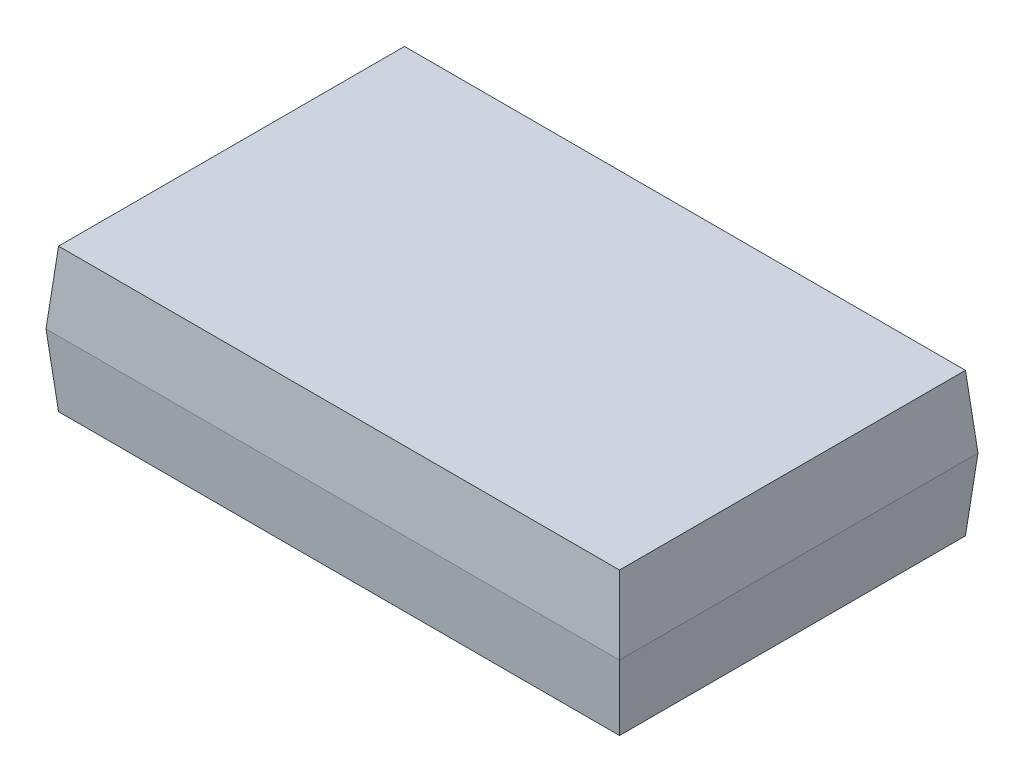
ISO-10303-21;
HEADER;
FILE_DESCRIPTION(('STEP AP214'),'2;1');
FILE_NAME('part.step','',(''),(''),'','','');
FILE_SCHEMA(('AUTOMOTIVE_DESIGN { 1 0 10303 214 1 1 1 1 }'));
ENDSEC;
DATA;
#1=APPLICATION_CONTEXT('core data for automotive mechanical design processes');
#2=APPLICATION_PROTOCOL_DEFINITION('international standard','automotive_design',2000,#1);
#3=PRODUCT_CONTEXT('',#1,'mechanical');
#4=PRODUCT('Part','Part','',(#3));
#5=PRODUCT_RELATED_PRODUCT_CATEGORY('part','',(#4));
#6=PRODUCT_DEFINITION_FORMATION('','',#4);
#7=PRODUCT_DEFINITION_CONTEXT('part definition',#1,'design');
#8=PRODUCT_DEFINITION('design','',#6,#7);
#9=PRODUCT_DEFINITION_SHAPE('','',#8);
#10=(LENGTH_UNIT() NAMED_UNIT(*) SI_UNIT(.MILLI.,.METRE.));
#11=(NAMED_UNIT(*) PLANE_ANGLE_UNIT() SI_UNIT($,.RADIAN.));
#12=(NAMED_UNIT(*) SI_UNIT($,.STERADIAN.) SOLID_ANGLE_UNIT());
#13=UNCERTAINTY_MEASURE_WITH_UNIT(LENGTH_MEASURE(1.E-05),#10,'distance_accuracy_value','');
#14=(GEOMETRIC_REPRESENTATION_CONTEXT(3) GLOBAL_UNCERTAINTY_ASSIGNED_CONTEXT((#13)) GLOBAL_UNIT_ASSIGNED_CONTEXT((#10,
#11,#12)) REPRESENTATION_CONTEXT('',''));
#15=CARTESIAN_POINT('',(0.,0.,0.));
#16=DIRECTION('',(0.,0.,1.));
#17=DIRECTION('',(1.,0.,0.));
#18=AXIS2_PLACEMENT_3D('',#15,#16,#17);
#19=CARTESIAN_POINT('',(2.,0.,1.25));
#20=DIRECTION('',(0.996194698091746,-0.0871557427476584,0.));
#21=DIRECTION('',(0.0871557427476584,0.996194698091746,0.));
#22=AXIS2_PLACEMENT_3D('',#19,#20,#21);
#23=PLANE('',#22);
#24=DIRECTION('',(0.,0.,-1.));
#25=VECTOR('',#24,1.);
#26=CARTESIAN_POINT('',(2.,0.,1.25));
#27=LINE('',#26,#25);
#28=CARTESIAN_POINT('',(2.,0.,1.25));
#29=VERTEX_POINT('',#28);
#30=CARTESIAN_POINT('',(2.,0.,-1.25));
#31=VERTEX_POINT('',#30);
#32=EDGE_CURVE('E102',#29,#31,#27,.T.);
#33=ORIENTED_EDGE('',*,*,#32,.F.);
#34=DIRECTION('',(0.0868265938642478,0.992432509138967,0.0868265938642478));
#35=VECTOR('',#34,1.);
#36=CARTESIAN_POINT('',(1.96984457039173,-0.344678137634742,1.21984457039173));
#37=LINE('',#36,#35);
#38=CARTESIAN_POINT('',(1.95625566823704,-0.5,1.20625566823704));
#39=VERTEX_POINT('',#38);
#40=EDGE_CURVE('E11',#39,#29,#37,.T.);
#41=ORIENTED_EDGE('',*,*,#40,.F.);
#42=DIRECTION('',(0.,0.,-1.));
#43=VECTOR('',#42,1.);
#44=CARTESIAN_POINT('',(1.95625566823704,-0.5,1.25));
#45=LINE('',#44,#43);
#46=CARTESIAN_POINT('',(1.95625566823704,-0.5,-1.20625566823704));
#47=VERTEX_POINT('',#46);
#48=EDGE_CURVE('E125',#39,#47,#45,.T.);
#49=ORIENTED_EDGE('',*,*,#48,.T.);
#50=DIRECTION('',(0.0868265938642478,0.992432509138967,-0.0868265938642478));
#51=VECTOR('',#50,1.);
#52=CARTESIAN_POINT('',(1.98115285649483,-0.215423836021714,-1.23115285649483));
#53=LINE('',#52,#51);
#54=EDGE_CURVE('E80',#47,#31,#53,.T.);
#55=ORIENTED_EDGE('',*,*,#54,.T.);
#56=EDGE_LOOP('',(#33,#41,#49,#55));
#57=FACE_BOUND('',#56,.T.);
#58=ADVANCED_FACE('F43',(#57),#23,.T.);
#59=CARTESIAN_POINT('',(-2.,0.,1.25));
#60=DIRECTION('',(0.,-0.0871557427476584,0.996194698091746));
#61=DIRECTION('',(0.,-0.996194698091746,-0.0871557427476584));
#62=AXIS2_PLACEMENT_3D('',#59,#60,#61);
#63=PLANE('',#62);
#64=DIRECTION('',(1.,0.,0.));
#65=VECTOR('',#64,1.);
#66=CARTESIAN_POINT('',(-2.,0.,1.25));
#67=LINE('',#66,#65);
#68=CARTESIAN_POINT('',(-2.,0.,1.25));
#69=VERTEX_POINT('',#68);
#70=EDGE_CURVE('E112',#69,#29,#67,.T.);
#71=ORIENTED_EDGE('',*,*,#70,.F.);
#72=DIRECTION('',(-0.0868265938642478,0.992432509138967,0.0868265938642478));
#73=VECTOR('',#72,1.);
#74=CARTESIAN_POINT('',(-2.,0.,1.25));
#75=LINE('',#74,#73);
#76=CARTESIAN_POINT('',(-1.95625566823704,-0.5,1.20625566823704));
#77=VERTEX_POINT('',#76);
#78=EDGE_CURVE('E53',#77,#69,#75,.T.);
#79=ORIENTED_EDGE('',*,*,#78,.F.);
#80=DIRECTION('',(1.,0.,0.));
#81=VECTOR('',#80,1.);
#82=CARTESIAN_POINT('',(-2.,-0.5,1.20625566823704));
#83=LINE('',#82,#81);
#84=EDGE_CURVE('E115',#77,#39,#83,.T.);
#85=ORIENTED_EDGE('',*,*,#84,.T.);
#86=ORIENTED_EDGE('',*,*,#40,.T.);
#87=EDGE_LOOP('',(#71,#79,#85,#86));
#88=FACE_BOUND('',#87,.T.);
#89=ADVANCED_FACE('F45',(#88),#63,.T.);
#90=CARTESIAN_POINT('',(-2.,0.,1.25));
#91=DIRECTION('',(-0.996194698091746,-0.0871557427476584,0.));
#92=DIRECTION('',(0.0871557427476584,-0.996194698091746,0.));
#93=AXIS2_PLACEMENT_3D('',#90,#91,#92);
#94=PLANE('',#93);
#95=DIRECTION('',(0.,0.,1.));
#96=VECTOR('',#95,1.);
#97=CARTESIAN_POINT('',(-2.,0.,1.25));
#98=LINE('',#97,#96);
#99=CARTESIAN_POINT('',(-2.,0.,-1.25));
#100=VERTEX_POINT('',#99);
#101=EDGE_CURVE('E126',#100,#69,#98,.T.);
#102=ORIENTED_EDGE('',*,*,#101,.F.);
#103=DIRECTION('',(-0.0868265938642478,0.992432509138967,-0.0868265938642478));
#104=VECTOR('',#103,1.);
#105=CARTESIAN_POINT('',(-2.,0.,-1.25));
#106=LINE('',#105,#104);
#107=CARTESIAN_POINT('',(-1.95625566823704,-0.5,-1.20625566823704));
#108=VERTEX_POINT('',#107);
#109=EDGE_CURVE('E73',#108,#100,#106,.T.);
#110=ORIENTED_EDGE('',*,*,#109,.F.);
#111=DIRECTION('',(0.,0.,1.));
#112=VECTOR('',#111,1.);
#113=CARTESIAN_POINT('',(-1.95625566823704,-0.5,1.25));
#114=LINE('',#113,#112);
#115=EDGE_CURVE('E152',#108,#77,#114,.T.);
#116=ORIENTED_EDGE('',*,*,#115,.T.);
#117=ORIENTED_EDGE('',*,*,#78,.T.);
#118=EDGE_LOOP('',(#102,#110,#116,#117));
#119=FACE_BOUND('',#118,.T.);
#120=ADVANCED_FACE('F164',(#119),#94,.T.);
#121=CARTESIAN_POINT('',(-2.,0.,-1.25));
#122=DIRECTION('',(0.,-0.0871557427476584,-0.996194698091746));
#123=DIRECTION('',(0.,0.996194698091746,-0.0871557427476584));
#124=AXIS2_PLACEMENT_3D('',#121,#122,#123);
#125=PLANE('',#124);
#126=DIRECTION('',(-1.,0.,0.));
#127=VECTOR('',#126,1.);
#128=CARTESIAN_POINT('',(-2.,0.,-1.25));
#129=LINE('',#128,#127);
#130=EDGE_CURVE('E106',#31,#100,#129,.T.);
#131=ORIENTED_EDGE('',*,*,#130,.F.);
#132=ORIENTED_EDGE('',*,*,#54,.F.);
#133=DIRECTION('',(-1.,0.,0.));
#134=VECTOR('',#133,1.);
#135=CARTESIAN_POINT('',(-2.,-0.5,-1.20625566823704));
#136=LINE('',#135,#134);
#137=EDGE_CURVE('E47',#47,#108,#136,.T.);
#138=ORIENTED_EDGE('',*,*,#137,.T.);
#139=ORIENTED_EDGE('',*,*,#109,.T.);
#140=EDGE_LOOP('',(#131,#132,#138,#139));
#141=FACE_BOUND('',#140,.T.);
#142=ADVANCED_FACE('F153',(#141),#125,.T.);
#143=CARTESIAN_POINT('',(0.,-0.5,0.));
#144=DIRECTION('',(0.,-1.,0.));
#145=DIRECTION('',(0.,0.,-1.));
#146=AXIS2_PLACEMENT_3D('',#143,#144,#145);
#147=PLANE('',#146);
#148=ORIENTED_EDGE('',*,*,#48,.F.);
#149=ORIENTED_EDGE('',*,*,#84,.F.);
#150=ORIENTED_EDGE('',*,*,#115,.F.);
#151=ORIENTED_EDGE('',*,*,#137,.F.);
#152=EDGE_LOOP('',(#148,#149,#150,#151));
#153=FACE_BOUND('',#152,.T.);
#154=ADVANCED_FACE('F155',(#153),#147,.T.);
#155=CARTESIAN_POINT('',(2.,0.,1.25));
#156=DIRECTION('',(0.996194698091746,0.0871557427476584,0.));
#157=DIRECTION('',(-0.0871557427476584,0.996194698091746,0.));
#158=AXIS2_PLACEMENT_3D('',#155,#156,#157);
#159=PLANE('',#158);
#160=ORIENTED_EDGE('',*,*,#32,.T.);
#161=DIRECTION('',(0.0868265938642478,-0.992432509138967,-0.0868265938642478));
#162=VECTOR('',#161,1.);
#163=CARTESIAN_POINT('',(1.96984457039173,0.344678137634742,-1.21984457039173));
#164=LINE('',#163,#162);
#165=CARTESIAN_POINT('',(1.95625566823704,0.5,-1.20625566823704));
#166=VERTEX_POINT('',#165);
#167=EDGE_CURVE('E107',#166,#31,#164,.T.);
#168=ORIENTED_EDGE('',*,*,#167,.F.);
#169=DIRECTION('',(0.,0.,1.));
#170=VECTOR('',#169,1.);
#171=CARTESIAN_POINT('',(1.95625566823704,0.5,0.));
#172=LINE('',#171,#170);
#173=CARTESIAN_POINT('',(1.95625566823704,0.5,1.20625566823704));
#174=VERTEX_POINT('',#173);
#175=EDGE_CURVE('E130',#174,#166,#172,.F.);
#176=ORIENTED_EDGE('',*,*,#175,.F.);
#177=DIRECTION('',(0.0868265938642478,-0.992432509138967,0.0868265938642478));
#178=VECTOR('',#177,1.);
#179=CARTESIAN_POINT('',(2.,0.,1.25));
#180=LINE('',#179,#178);
#181=EDGE_CURVE('E121',#174,#29,#180,.T.);
#182=ORIENTED_EDGE('',*,*,#181,.T.);
#183=EDGE_LOOP('',(#160,#168,#176,#182));
#184=FACE_BOUND('',#183,.T.);
#185=ADVANCED_FACE('F128',(#184),#159,.T.);
#186=CARTESIAN_POINT('',(-2.,0.,-1.25));
#187=DIRECTION('',(0.,0.0871557427476584,-0.996194698091746));
#188=DIRECTION('',(0.,0.996194698091746,0.0871557427476584));
#189=AXIS2_PLACEMENT_3D('',#186,#187,#188);
#190=PLANE('',#189);
#191=ORIENTED_EDGE('',*,*,#130,.T.);
#192=DIRECTION('',(-0.0868265938642478,-0.992432509138967,-0.0868265938642478));
#193=VECTOR('',#192,1.);
#194=CARTESIAN_POINT('',(-1.98115285649483,0.215423836021714,-1.23115285649483));
#195=LINE('',#194,#193);
#196=CARTESIAN_POINT('',(-1.95625566823704,0.5,-1.20625566823704));
#197=VERTEX_POINT('',#196);
#198=EDGE_CURVE('E133',#197,#100,#195,.T.);
#199=ORIENTED_EDGE('',*,*,#198,.F.);
#200=DIRECTION('',(1.,0.,0.));
#201=VECTOR('',#200,1.);
#202=CARTESIAN_POINT('',(0.,0.5,-1.20625566823704));
#203=LINE('',#202,#201);
#204=EDGE_CURVE('E142',#166,#197,#203,.F.);
#205=ORIENTED_EDGE('',*,*,#204,.F.);
#206=ORIENTED_EDGE('',*,*,#167,.T.);
#207=EDGE_LOOP('',(#191,#199,#205,#206));
#208=FACE_BOUND('',#207,.T.);
#209=ADVANCED_FACE('F162',(#208),#190,.T.);
#210=CARTESIAN_POINT('',(-2.,0.,1.25));
#211=DIRECTION('',(-0.996194698091746,0.0871557427476584,0.));
#212=DIRECTION('',(-0.0871557427476584,-0.996194698091746,0.));
#213=AXIS2_PLACEMENT_3D('',#210,#211,#212);
#214=PLANE('',#213);
#215=ORIENTED_EDGE('',*,*,#101,.T.);
#216=DIRECTION('',(-0.0868265938642478,-0.992432509138967,0.0868265938642478));
#217=VECTOR('',#216,1.);
#218=CARTESIAN_POINT('',(-2.,0.,1.25));
#219=LINE('',#218,#217);
#220=CARTESIAN_POINT('',(-1.95625566823704,0.5,1.20625566823704));
#221=VERTEX_POINT('',#220);
#222=EDGE_CURVE('E124',#221,#69,#219,.T.);
#223=ORIENTED_EDGE('',*,*,#222,.F.);
#224=DIRECTION('',(0.,0.,-1.));
#225=VECTOR('',#224,1.);
#226=CARTESIAN_POINT('',(-1.95625566823704,0.5,0.));
#227=LINE('',#226,#225);
#228=EDGE_CURVE('E135',#197,#221,#227,.F.);
#229=ORIENTED_EDGE('',*,*,#228,.F.);
#230=ORIENTED_EDGE('',*,*,#198,.T.);
#231=EDGE_LOOP('',(#215,#223,#229,#230));
#232=FACE_BOUND('',#231,.T.);
#233=ADVANCED_FACE('F180',(#232),#214,.T.);
#234=CARTESIAN_POINT('',(-2.,0.,1.25));
#235=DIRECTION('',(0.,0.0871557427476584,0.996194698091746));
#236=DIRECTION('',(0.,-0.996194698091746,0.0871557427476584));
#237=AXIS2_PLACEMENT_3D('',#234,#235,#236);
#238=PLANE('',#237);
#239=ORIENTED_EDGE('',*,*,#70,.T.);
#240=ORIENTED_EDGE('',*,*,#181,.F.);
#241=DIRECTION('',(-1.,0.,0.));
#242=VECTOR('',#241,1.);
#243=CARTESIAN_POINT('',(0.,0.5,1.20625566823704));
#244=LINE('',#243,#242);
#245=EDGE_CURVE('E131',#221,#174,#244,.F.);
#246=ORIENTED_EDGE('',*,*,#245,.F.);
#247=ORIENTED_EDGE('',*,*,#222,.T.);
#248=EDGE_LOOP('',(#239,#240,#246,#247));
#249=FACE_BOUND('',#248,.T.);
#250=ADVANCED_FACE('F119',(#249),#238,.T.);
#251=CARTESIAN_POINT('',(0.,0.5,0.));
#252=DIRECTION('',(0.,-1.,0.));
#253=DIRECTION('',(0.,0.,-1.));
#254=AXIS2_PLACEMENT_3D('',#251,#252,#253);
#255=PLANE('',#254);
#256=ORIENTED_EDGE('',*,*,#175,.T.);
#257=ORIENTED_EDGE('',*,*,#204,.T.);
#258=ORIENTED_EDGE('',*,*,#228,.T.);
#259=ORIENTED_EDGE('',*,*,#245,.T.);
#260=EDGE_LOOP('',(#256,#257,#258,#259));
#261=FACE_BOUND('',#260,.T.);
#262=ADVANCED_FACE('F182',(#261),#255,.F.);
#263=CLOSED_SHELL('',(#58,#89,#120,#142,#154,#185,#209,#233,#250,#262));
#264=MANIFOLD_SOLID_BREP('B2',#263);
#265=ADVANCED_BREP_SHAPE_REPRESENTATION('',(#18,#264),#14);
#266=SHAPE_DEFINITION_REPRESENTATION(#9,#265);
ENDSEC;
END-ISO-10303-21;
